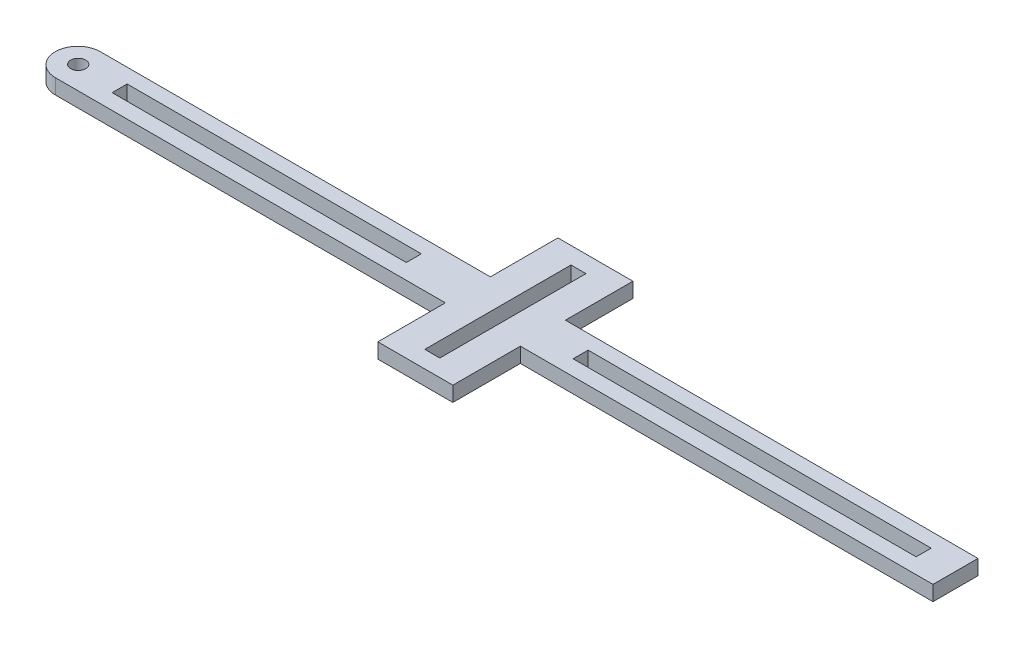
ISO-10303-21;
HEADER;
FILE_DESCRIPTION(('STEP AP214'),'2;1');
FILE_NAME('part.step','',(''),(''),'','','');
FILE_SCHEMA(('AUTOMOTIVE_DESIGN { 1 0 10303 214 1 1 1 1 }'));
ENDSEC;
DATA;
#1=APPLICATION_CONTEXT('core data for automotive mechanical design processes');
#2=APPLICATION_PROTOCOL_DEFINITION('international standard','automotive_design',2000,#1);
#3=PRODUCT_CONTEXT('',#1,'mechanical');
#4=PRODUCT('Part','Part','',(#3));
#5=PRODUCT_RELATED_PRODUCT_CATEGORY('part','',(#4));
#6=PRODUCT_DEFINITION_FORMATION('','',#4);
#7=PRODUCT_DEFINITION_CONTEXT('part definition',#1,'design');
#8=PRODUCT_DEFINITION('design','',#6,#7);
#9=PRODUCT_DEFINITION_SHAPE('','',#8);
#10=(LENGTH_UNIT() NAMED_UNIT(*) SI_UNIT(.MILLI.,.METRE.));
#11=(NAMED_UNIT(*) PLANE_ANGLE_UNIT() SI_UNIT($,.RADIAN.));
#12=(NAMED_UNIT(*) SI_UNIT($,.STERADIAN.) SOLID_ANGLE_UNIT());
#13=UNCERTAINTY_MEASURE_WITH_UNIT(LENGTH_MEASURE(1.E-05),#10,'distance_accuracy_value','');
#14=(GEOMETRIC_REPRESENTATION_CONTEXT(3) GLOBAL_UNCERTAINTY_ASSIGNED_CONTEXT((#13)) GLOBAL_UNIT_ASSIGNED_CONTEXT((#10,
#11,#12)) REPRESENTATION_CONTEXT('',''));
#15=CARTESIAN_POINT('',(0.,0.,0.));
#16=DIRECTION('',(0.,0.,1.));
#17=DIRECTION('',(1.,0.,0.));
#18=AXIS2_PLACEMENT_3D('',#15,#16,#17);
#19=CARTESIAN_POINT('',(0.,2.,0.));
#20=DIRECTION('',(0.,1.,0.));
#21=DIRECTION('',(0.,0.,1.));
#22=AXIS2_PLACEMENT_3D('',#19,#20,#21);
#23=PLANE('',#22);
#24=DIRECTION('',(-1.,0.,0.));
#25=VECTOR('',#24,1.);
#26=CARTESIAN_POINT('',(-60.,2.,-3.));
#27=LINE('',#26,#25);
#28=CARTESIAN_POINT('',(-4.99999999999996,2.,-3.));
#29=VERTEX_POINT('',#28);
#30=CARTESIAN_POINT('',(-57.,2.,-3.));
#31=VERTEX_POINT('',#30);
#32=EDGE_CURVE('E372',#29,#31,#27,.T.);
#33=ORIENTED_EDGE('',*,*,#32,.T.);
#34=CARTESIAN_POINT('',(-57.,2.,0.));
#35=DIRECTION('',(0.,1.,0.));
#36=DIRECTION('',(0.,0.,1.));
#37=AXIS2_PLACEMENT_3D('',#34,#35,#36);
#38=CIRCLE('',#37,3.);
#39=CARTESIAN_POINT('',(-60.,2.,0.));
#40=VERTEX_POINT('',#39);
#41=EDGE_CURVE('E55',#31,#40,#38,.T.);
#42=ORIENTED_EDGE('',*,*,#41,.T.);
#43=CARTESIAN_POINT('',(-57.,2.,0.));
#44=DIRECTION('',(0.,1.,0.));
#45=DIRECTION('',(0.,0.,1.));
#46=AXIS2_PLACEMENT_3D('',#43,#44,#45);
#47=CIRCLE('',#46,3.);
#48=CARTESIAN_POINT('',(-57.,2.,3.));
#49=VERTEX_POINT('',#48);
#50=EDGE_CURVE('E62',#40,#49,#47,.T.);
#51=ORIENTED_EDGE('',*,*,#50,.T.);
#52=DIRECTION('',(1.,0.,0.));
#53=VECTOR('',#52,1.);
#54=CARTESIAN_POINT('',(-60.,2.,3.));
#55=LINE('',#54,#53);
#56=CARTESIAN_POINT('',(-4.99999999999996,2.,3.));
#57=VERTEX_POINT('',#56);
#58=EDGE_CURVE('E375',#49,#57,#55,.T.);
#59=ORIENTED_EDGE('',*,*,#58,.T.);
#60=DIRECTION('',(0.,0.,1.));
#61=VECTOR('',#60,1.);
#62=CARTESIAN_POINT('',(-4.99999999999997,2.,12.));
#63=LINE('',#62,#61);
#64=CARTESIAN_POINT('',(-4.99999999999997,2.,12.));
#65=VERTEX_POINT('',#64);
#66=EDGE_CURVE('E378',#57,#65,#63,.T.);
#67=ORIENTED_EDGE('',*,*,#66,.T.);
#68=DIRECTION('',(1.,0.,0.));
#69=VECTOR('',#68,1.);
#70=CARTESIAN_POINT('',(-4.99999999999997,2.,12.));
#71=LINE('',#70,#69);
#72=CARTESIAN_POINT('',(5.00000000000003,2.,12.));
#73=VERTEX_POINT('',#72);
#74=EDGE_CURVE('E381',#65,#73,#71,.T.);
#75=ORIENTED_EDGE('',*,*,#74,.T.);
#76=DIRECTION('',(0.,0.,-1.));
#77=VECTOR('',#76,1.);
#78=CARTESIAN_POINT('',(5.00000000000003,2.,12.));
#79=LINE('',#78,#77);
#80=CARTESIAN_POINT('',(5.00000000000004,2.,3.));
#81=VERTEX_POINT('',#80);
#82=EDGE_CURVE('E384',#73,#81,#79,.T.);
#83=ORIENTED_EDGE('',*,*,#82,.T.);
#84=DIRECTION('',(1.,0.,0.));
#85=VECTOR('',#84,1.);
#86=CARTESIAN_POINT('',(5.00000000000004,2.,3.));
#87=LINE('',#86,#85);
#88=CARTESIAN_POINT('',(60.,2.,3.));
#89=VERTEX_POINT('',#88);
#90=EDGE_CURVE('E387',#81,#89,#87,.T.);
#91=ORIENTED_EDGE('',*,*,#90,.T.);
#92=DIRECTION('',(0.,0.,-1.));
#93=VECTOR('',#92,1.);
#94=CARTESIAN_POINT('',(60.,2.,3.));
#95=LINE('',#94,#93);
#96=CARTESIAN_POINT('',(60.,2.,-3.));
#97=VERTEX_POINT('',#96);
#98=EDGE_CURVE('E390',#89,#97,#95,.T.);
#99=ORIENTED_EDGE('',*,*,#98,.T.);
#100=DIRECTION('',(-1.,0.,0.));
#101=VECTOR('',#100,1.);
#102=CARTESIAN_POINT('',(5.00000000000004,2.,-3.));
#103=LINE('',#102,#101);
#104=CARTESIAN_POINT('',(5.00000000000004,2.,-3.));
#105=VERTEX_POINT('',#104);
#106=EDGE_CURVE('E358',#97,#105,#103,.T.);
#107=ORIENTED_EDGE('',*,*,#106,.T.);
#108=DIRECTION('',(0.,0.,-1.));
#109=VECTOR('',#108,1.);
#110=CARTESIAN_POINT('',(5.00000000000004,2.,-3.));
#111=LINE('',#110,#109);
#112=CARTESIAN_POINT('',(5.00000000000003,2.,-12.));
#113=VERTEX_POINT('',#112);
#114=EDGE_CURVE('E362',#105,#113,#111,.T.);
#115=ORIENTED_EDGE('',*,*,#114,.T.);
#116=DIRECTION('',(-1.,0.,0.));
#117=VECTOR('',#116,1.);
#118=CARTESIAN_POINT('',(-4.99999999999997,2.,-12.));
#119=LINE('',#118,#117);
#120=CARTESIAN_POINT('',(-4.99999999999997,2.,-12.));
#121=VERTEX_POINT('',#120);
#122=EDGE_CURVE('E366',#113,#121,#119,.T.);
#123=ORIENTED_EDGE('',*,*,#122,.T.);
#124=DIRECTION('',(0.,0.,1.));
#125=VECTOR('',#124,1.);
#126=CARTESIAN_POINT('',(-4.99999999999996,2.,-3.));
#127=LINE('',#126,#125);
#128=EDGE_CURVE('E369',#121,#29,#127,.T.);
#129=ORIENTED_EDGE('',*,*,#128,.T.);
#130=EDGE_LOOP('',(#33,#42,#51,#59,#67,#75,#83,#91,#99,#107,#115,#123,#129));
#131=FACE_BOUND('',#130,.T.);
#132=CARTESIAN_POINT('',(-57.,2.,-0.0574949843376246));
#133=DIRECTION('',(0.,1.,0.));
#134=DIRECTION('',(0.,0.,1.));
#135=AXIS2_PLACEMENT_3D('',#132,#133,#134);
#136=CIRCLE('',#135,0.999999999999998);
#137=CARTESIAN_POINT('',(-57.,2.,0.942505015662373));
#138=VERTEX_POINT('',#137);
#139=EDGE_CURVE('E350',#138,#138,#136,.T.);
#140=ORIENTED_EDGE('',*,*,#139,.F.);
#141=EDGE_LOOP('',(#140));
#142=FACE_BOUND('',#141,.T.);
#143=DIRECTION('',(1.,0.,0.));
#144=VECTOR('',#143,1.);
#145=CARTESIAN_POINT('',(-12.2613313265383,2.,0.942505015662373));
#146=LINE('',#145,#144);
#147=CARTESIAN_POINT('',(-51.4745774109556,2.,0.942505015662377));
#148=VERTEX_POINT('',#147);
#149=CARTESIAN_POINT('',(-12.2613313265383,2.,0.942505015662373));
#150=VERTEX_POINT('',#149);
#151=EDGE_CURVE('E310',#148,#150,#146,.T.);
#152=ORIENTED_EDGE('',*,*,#151,.F.);
#153=DIRECTION('',(0.,0.,1.));
#154=VECTOR('',#153,1.);
#155=CARTESIAN_POINT('',(-51.4745774109556,2.,0.942505015662377));
#156=LINE('',#155,#154);
#157=CARTESIAN_POINT('',(-51.4745774109556,2.,-1.05749498433762));
#158=VERTEX_POINT('',#157);
#159=EDGE_CURVE('E307',#158,#148,#156,.T.);
#160=ORIENTED_EDGE('',*,*,#159,.F.);
#161=DIRECTION('',(-1.,0.,0.));
#162=VECTOR('',#161,1.);
#163=CARTESIAN_POINT('',(-12.2613313265383,2.,-1.05749498433763));
#164=LINE('',#163,#162);
#165=CARTESIAN_POINT('',(-12.2613313265383,2.,-1.05749498433763));
#166=VERTEX_POINT('',#165);
#167=EDGE_CURVE('E318',#166,#158,#164,.T.);
#168=ORIENTED_EDGE('',*,*,#167,.F.);
#169=DIRECTION('',(0.,0.,-1.));
#170=VECTOR('',#169,1.);
#171=CARTESIAN_POINT('',(-12.2613313265383,2.,0.942505015662373));
#172=LINE('',#171,#170);
#173=EDGE_CURVE('E314',#150,#166,#172,.T.);
#174=ORIENTED_EDGE('',*,*,#173,.F.);
#175=EDGE_LOOP('',(#152,#160,#168,#174));
#176=FACE_BOUND('',#175,.T.);
#177=DIRECTION('',(-1.,0.,0.));
#178=VECTOR('',#177,1.);
#179=CARTESIAN_POINT('',(9.96933650610281,2.,-1.05749498433763));
#180=LINE('',#179,#178);
#181=CARTESIAN_POINT('',(55.6961401368462,2.,-1.05749498433763));
#182=VERTEX_POINT('',#181);
#183=CARTESIAN_POINT('',(9.96933650610281,2.,-1.05749498433763));
#184=VERTEX_POINT('',#183);
#185=EDGE_CURVE('E267',#182,#184,#180,.T.);
#186=ORIENTED_EDGE('',*,*,#185,.F.);
#187=DIRECTION('',(0.,0.,-1.));
#188=VECTOR('',#187,1.);
#189=CARTESIAN_POINT('',(55.6961401368462,2.,0.942505015662373));
#190=LINE('',#189,#188);
#191=CARTESIAN_POINT('',(55.6961401368462,2.,0.942505015662373));
#192=VERTEX_POINT('',#191);
#193=EDGE_CURVE('E264',#192,#182,#190,.T.);
#194=ORIENTED_EDGE('',*,*,#193,.F.);
#195=DIRECTION('',(1.,0.,0.));
#196=VECTOR('',#195,1.);
#197=CARTESIAN_POINT('',(9.96933650610281,2.,0.942505015662373));
#198=LINE('',#197,#196);
#199=CARTESIAN_POINT('',(9.96933650610281,2.,0.942505015662373));
#200=VERTEX_POINT('',#199);
#201=EDGE_CURVE('E275',#200,#192,#198,.T.);
#202=ORIENTED_EDGE('',*,*,#201,.F.);
#203=DIRECTION('',(0.,0.,1.));
#204=VECTOR('',#203,1.);
#205=CARTESIAN_POINT('',(9.96933650610281,2.,0.942505015662373));
#206=LINE('',#205,#204);
#207=EDGE_CURVE('E271',#184,#200,#206,.T.);
#208=ORIENTED_EDGE('',*,*,#207,.F.);
#209=EDGE_LOOP('',(#186,#194,#202,#208));
#210=FACE_BOUND('',#209,.T.);
#211=DIRECTION('',(-1.,0.,0.));
#212=VECTOR('',#211,1.);
#213=CARTESIAN_POINT('',(-0.999999999999993,2.,-9.74227650075931));
#214=LINE('',#213,#212);
#215=CARTESIAN_POINT('',(1.00000000000001,2.,-9.74227650075931));
#216=VERTEX_POINT('',#215);
#217=CARTESIAN_POINT('',(-0.999999999999993,2.,-9.74227650075931));
#218=VERTEX_POINT('',#217);
#219=EDGE_CURVE('E222',#216,#218,#214,.T.);
#220=ORIENTED_EDGE('',*,*,#219,.F.);
#221=DIRECTION('',(0.,0.,-1.));
#222=VECTOR('',#221,1.);
#223=CARTESIAN_POINT('',(1.00000000000001,2.,9.74227650075932));
#224=LINE('',#223,#222);
#225=CARTESIAN_POINT('',(1.00000000000001,2.,9.74227650075932));
#226=VERTEX_POINT('',#225);
#227=EDGE_CURVE('E211',#226,#216,#224,.T.);
#228=ORIENTED_EDGE('',*,*,#227,.F.);
#229=DIRECTION('',(1.,0.,0.));
#230=VECTOR('',#229,1.);
#231=CARTESIAN_POINT('',(-0.999999999999993,2.,9.74227650075932));
#232=LINE('',#231,#230);
#233=CARTESIAN_POINT('',(-0.999999999999993,2.,9.74227650075932));
#234=VERTEX_POINT('',#233);
#235=EDGE_CURVE('E240',#234,#226,#232,.T.);
#236=ORIENTED_EDGE('',*,*,#235,.F.);
#237=DIRECTION('',(0.,0.,1.));
#238=VECTOR('',#237,1.);
#239=CARTESIAN_POINT('',(-0.999999999999993,2.,9.74227650075932));
#240=LINE('',#239,#238);
#241=EDGE_CURVE('E236',#218,#234,#240,.T.);
#242=ORIENTED_EDGE('',*,*,#241,.F.);
#243=EDGE_LOOP('',(#220,#228,#236,#242));
#244=FACE_BOUND('',#243,.T.);
#245=ADVANCED_FACE('F45',(#131,#142,#176,#210,#244),#23,.T.);
#246=CARTESIAN_POINT('',(0.,0.,0.));
#247=DIRECTION('',(0.,1.,0.));
#248=DIRECTION('',(0.,0.,1.));
#249=AXIS2_PLACEMENT_3D('',#246,#247,#248);
#250=PLANE('',#249);
#251=DIRECTION('',(0.,0.,-1.));
#252=VECTOR('',#251,1.);
#253=CARTESIAN_POINT('',(55.6961401368462,0.,0.942505015662373));
#254=LINE('',#253,#252);
#255=CARTESIAN_POINT('',(55.6961401368462,0.,0.942505015662373));
#256=VERTEX_POINT('',#255);
#257=CARTESIAN_POINT('',(55.6961401368462,0.,-1.05749498433763));
#258=VERTEX_POINT('',#257);
#259=EDGE_CURVE('E231',#256,#258,#254,.T.);
#260=ORIENTED_EDGE('',*,*,#259,.T.);
#261=DIRECTION('',(-1.,0.,0.));
#262=VECTOR('',#261,1.);
#263=CARTESIAN_POINT('',(9.96933650610281,0.,-1.05749498433763));
#264=LINE('',#263,#262);
#265=CARTESIAN_POINT('',(9.96933650610281,0.,-1.05749498433763));
#266=VERTEX_POINT('',#265);
#267=EDGE_CURVE('E282',#258,#266,#264,.T.);
#268=ORIENTED_EDGE('',*,*,#267,.T.);
#269=DIRECTION('',(0.,0.,1.));
#270=VECTOR('',#269,1.);
#271=CARTESIAN_POINT('',(9.96933650610281,0.,0.942505015662373));
#272=LINE('',#271,#270);
#273=CARTESIAN_POINT('',(9.96933650610281,0.,0.942505015662373));
#274=VERTEX_POINT('',#273);
#275=EDGE_CURVE('E286',#266,#274,#272,.T.);
#276=ORIENTED_EDGE('',*,*,#275,.T.);
#277=DIRECTION('',(1.,0.,0.));
#278=VECTOR('',#277,1.);
#279=CARTESIAN_POINT('',(9.96933650610281,0.,0.942505015662373));
#280=LINE('',#279,#278);
#281=EDGE_CURVE('E268',#274,#256,#280,.T.);
#282=ORIENTED_EDGE('',*,*,#281,.T.);
#283=EDGE_LOOP('',(#260,#268,#276,#282));
#284=FACE_BOUND('',#283,.T.);
#285=CARTESIAN_POINT('',(-57.,0.,-0.0574949843376246));
#286=DIRECTION('',(0.,1.,0.));
#287=DIRECTION('',(0.,0.,1.));
#288=AXIS2_PLACEMENT_3D('',#285,#286,#287);
#289=CIRCLE('',#288,0.999999999999998);
#290=CARTESIAN_POINT('',(-57.,0.,0.942505015662373));
#291=VERTEX_POINT('',#290);
#292=EDGE_CURVE('E349',#291,#291,#289,.T.);
#293=ORIENTED_EDGE('',*,*,#292,.T.);
#294=EDGE_LOOP('',(#293));
#295=FACE_BOUND('',#294,.T.);
#296=CARTESIAN_POINT('',(-57.,0.,0.));
#297=DIRECTION('',(0.,1.,0.));
#298=DIRECTION('',(0.,0.,1.));
#299=AXIS2_PLACEMENT_3D('',#296,#297,#298);
#300=CIRCLE('',#299,3.);
#301=CARTESIAN_POINT('',(-57.,0.,3.));
#302=VERTEX_POINT('',#301);
#303=CARTESIAN_POINT('',(-60.,0.,0.));
#304=VERTEX_POINT('',#303);
#305=EDGE_CURVE('E466',#302,#304,#300,.F.);
#306=ORIENTED_EDGE('',*,*,#305,.T.);
#307=CARTESIAN_POINT('',(-57.,0.,0.));
#308=DIRECTION('',(0.,1.,0.));
#309=DIRECTION('',(0.,0.,1.));
#310=AXIS2_PLACEMENT_3D('',#307,#308,#309);
#311=CIRCLE('',#310,3.);
#312=CARTESIAN_POINT('',(-57.,0.,-3.));
#313=VERTEX_POINT('',#312);
#314=EDGE_CURVE('E469',#304,#313,#311,.F.);
#315=ORIENTED_EDGE('',*,*,#314,.T.);
#316=DIRECTION('',(-1.,0.,0.));
#317=VECTOR('',#316,1.);
#318=CARTESIAN_POINT('',(-60.,0.,-3.));
#319=LINE('',#318,#317);
#320=CARTESIAN_POINT('',(-4.99999999999996,0.,-3.));
#321=VERTEX_POINT('',#320);
#322=EDGE_CURVE('E406',#321,#313,#319,.T.);
#323=ORIENTED_EDGE('',*,*,#322,.F.);
#324=DIRECTION('',(0.,0.,1.));
#325=VECTOR('',#324,1.);
#326=CARTESIAN_POINT('',(-4.99999999999996,0.,-3.));
#327=LINE('',#326,#325);
#328=CARTESIAN_POINT('',(-4.99999999999997,0.,-12.));
#329=VERTEX_POINT('',#328);
#330=EDGE_CURVE('E403',#329,#321,#327,.T.);
#331=ORIENTED_EDGE('',*,*,#330,.F.);
#332=DIRECTION('',(-1.,0.,0.));
#333=VECTOR('',#332,1.);
#334=CARTESIAN_POINT('',(-4.99999999999997,0.,-12.));
#335=LINE('',#334,#333);
#336=CARTESIAN_POINT('',(5.00000000000003,0.,-12.));
#337=VERTEX_POINT('',#336);
#338=EDGE_CURVE('E400',#337,#329,#335,.T.);
#339=ORIENTED_EDGE('',*,*,#338,.F.);
#340=DIRECTION('',(0.,0.,-1.));
#341=VECTOR('',#340,1.);
#342=CARTESIAN_POINT('',(5.00000000000004,0.,-3.));
#343=LINE('',#342,#341);
#344=CARTESIAN_POINT('',(5.00000000000004,0.,-3.));
#345=VERTEX_POINT('',#344);
#346=EDGE_CURVE('E397',#345,#337,#343,.T.);
#347=ORIENTED_EDGE('',*,*,#346,.F.);
#348=DIRECTION('',(-1.,0.,0.));
#349=VECTOR('',#348,1.);
#350=CARTESIAN_POINT('',(5.00000000000004,0.,-3.));
#351=LINE('',#350,#349);
#352=CARTESIAN_POINT('',(60.,0.,-3.));
#353=VERTEX_POINT('',#352);
#354=EDGE_CURVE('E354',#353,#345,#351,.T.);
#355=ORIENTED_EDGE('',*,*,#354,.F.);
#356=DIRECTION('',(0.,0.,-1.));
#357=VECTOR('',#356,1.);
#358=CARTESIAN_POINT('',(60.,0.,3.));
#359=LINE('',#358,#357);
#360=CARTESIAN_POINT('',(60.,0.,3.));
#361=VERTEX_POINT('',#360);
#362=EDGE_CURVE('E363',#361,#353,#359,.T.);
#363=ORIENTED_EDGE('',*,*,#362,.F.);
#364=DIRECTION('',(1.,0.,0.));
#365=VECTOR('',#364,1.);
#366=CARTESIAN_POINT('',(5.00000000000004,0.,3.));
#367=LINE('',#366,#365);
#368=CARTESIAN_POINT('',(5.00000000000004,0.,3.));
#369=VERTEX_POINT('',#368);
#370=EDGE_CURVE('E422',#369,#361,#367,.T.);
#371=ORIENTED_EDGE('',*,*,#370,.F.);
#372=DIRECTION('',(0.,0.,-1.));
#373=VECTOR('',#372,1.);
#374=CARTESIAN_POINT('',(5.00000000000003,0.,12.));
#375=LINE('',#374,#373);
#376=CARTESIAN_POINT('',(5.00000000000003,0.,12.));
#377=VERTEX_POINT('',#376);
#378=EDGE_CURVE('E419',#377,#369,#375,.T.);
#379=ORIENTED_EDGE('',*,*,#378,.F.);
#380=DIRECTION('',(1.,0.,0.));
#381=VECTOR('',#380,1.);
#382=CARTESIAN_POINT('',(-4.99999999999997,0.,12.));
#383=LINE('',#382,#381);
#384=CARTESIAN_POINT('',(-4.99999999999997,0.,12.));
#385=VERTEX_POINT('',#384);
#386=EDGE_CURVE('E416',#385,#377,#383,.T.);
#387=ORIENTED_EDGE('',*,*,#386,.F.);
#388=DIRECTION('',(0.,0.,1.));
#389=VECTOR('',#388,1.);
#390=CARTESIAN_POINT('',(-4.99999999999997,0.,12.));
#391=LINE('',#390,#389);
#392=CARTESIAN_POINT('',(-4.99999999999996,0.,3.));
#393=VERTEX_POINT('',#392);
#394=EDGE_CURVE('E413',#393,#385,#391,.T.);
#395=ORIENTED_EDGE('',*,*,#394,.F.);
#396=DIRECTION('',(1.,0.,0.));
#397=VECTOR('',#396,1.);
#398=CARTESIAN_POINT('',(-60.,0.,3.));
#399=LINE('',#398,#397);
#400=EDGE_CURVE('E410',#302,#393,#399,.T.);
#401=ORIENTED_EDGE('',*,*,#400,.F.);
#402=EDGE_LOOP('',(#306,#315,#323,#331,#339,#347,#355,#363,#371,#379,#387,#395,#401));
#403=FACE_BOUND('',#402,.T.);
#404=DIRECTION('',(0.,0.,1.));
#405=VECTOR('',#404,1.);
#406=CARTESIAN_POINT('',(-51.4745774109556,0.,0.942505015662377));
#407=LINE('',#406,#405);
#408=CARTESIAN_POINT('',(-51.4745774109556,0.,-1.05749498433762));
#409=VERTEX_POINT('',#408);
#410=CARTESIAN_POINT('',(-51.4745774109556,0.,0.942505015662377));
#411=VERTEX_POINT('',#410);
#412=EDGE_CURVE('E306',#409,#411,#407,.T.);
#413=ORIENTED_EDGE('',*,*,#412,.T.);
#414=DIRECTION('',(1.,0.,0.));
#415=VECTOR('',#414,1.);
#416=CARTESIAN_POINT('',(-12.2613313265383,0.,0.942505015662373));
#417=LINE('',#416,#415);
#418=CARTESIAN_POINT('',(-12.2613313265383,0.,0.942505015662373));
#419=VERTEX_POINT('',#418);
#420=EDGE_CURVE('E325',#411,#419,#417,.T.);
#421=ORIENTED_EDGE('',*,*,#420,.T.);
#422=DIRECTION('',(0.,0.,-1.));
#423=VECTOR('',#422,1.);
#424=CARTESIAN_POINT('',(-12.2613313265383,0.,0.942505015662373));
#425=LINE('',#424,#423);
#426=CARTESIAN_POINT('',(-12.2613313265383,0.,-1.05749498433763));
#427=VERTEX_POINT('',#426);
#428=EDGE_CURVE('E329',#419,#427,#425,.T.);
#429=ORIENTED_EDGE('',*,*,#428,.T.);
#430=DIRECTION('',(-1.,0.,0.));
#431=VECTOR('',#430,1.);
#432=CARTESIAN_POINT('',(-12.2613313265383,0.,-1.05749498433763));
#433=LINE('',#432,#431);
#434=EDGE_CURVE('E311',#427,#409,#433,.T.);
#435=ORIENTED_EDGE('',*,*,#434,.T.);
#436=EDGE_LOOP('',(#413,#421,#429,#435));
#437=FACE_BOUND('',#436,.T.);
#438=DIRECTION('',(0.,0.,-1.));
#439=VECTOR('',#438,1.);
#440=CARTESIAN_POINT('',(1.00000000000001,0.,9.74227650075932));
#441=LINE('',#440,#439);
#442=CARTESIAN_POINT('',(1.00000000000001,0.,9.74227650075932));
#443=VERTEX_POINT('',#442);
#444=CARTESIAN_POINT('',(1.00000000000001,0.,-9.74227650075931));
#445=VERTEX_POINT('',#444);
#446=EDGE_CURVE('E245',#443,#445,#441,.T.);
#447=ORIENTED_EDGE('',*,*,#446,.T.);
#448=DIRECTION('',(-1.,0.,0.));
#449=VECTOR('',#448,1.);
#450=CARTESIAN_POINT('',(-0.999999999999993,0.,-9.74227650075931));
#451=LINE('',#450,#449);
#452=CARTESIAN_POINT('',(-0.999999999999993,0.,-9.74227650075931));
#453=VERTEX_POINT('',#452);
#454=EDGE_CURVE('E229',#445,#453,#451,.T.);
#455=ORIENTED_EDGE('',*,*,#454,.T.);
#456=DIRECTION('',(0.,0.,1.));
#457=VECTOR('',#456,1.);
#458=CARTESIAN_POINT('',(-0.999999999999993,0.,9.74227650075932));
#459=LINE('',#458,#457);
#460=CARTESIAN_POINT('',(-0.999999999999993,0.,9.74227650075932));
#461=VERTEX_POINT('',#460);
#462=EDGE_CURVE('E250',#453,#461,#459,.T.);
#463=ORIENTED_EDGE('',*,*,#462,.T.);
#464=DIRECTION('',(1.,0.,0.));
#465=VECTOR('',#464,1.);
#466=CARTESIAN_POINT('',(-0.999999999999993,0.,9.74227650075932));
#467=LINE('',#466,#465);
#468=EDGE_CURVE('E223',#461,#443,#467,.T.);
#469=ORIENTED_EDGE('',*,*,#468,.T.);
#470=EDGE_LOOP('',(#447,#455,#463,#469));
#471=FACE_BOUND('',#470,.T.);
#472=ADVANCED_FACE('F495',(#284,#295,#403,#437,#471),#250,.F.);
#473=CARTESIAN_POINT('',(5.00000000000004,2.,-3.));
#474=DIRECTION('',(0.,0.,1.));
#475=DIRECTION('',(1.,0.,0.));
#476=AXIS2_PLACEMENT_3D('',#473,#474,#475);
#477=PLANE('',#476);
#478=ORIENTED_EDGE('',*,*,#354,.T.);
#479=DIRECTION('',(0.,-1.,0.));
#480=VECTOR('',#479,1.);
#481=CARTESIAN_POINT('',(5.00000000000004,2.,-3.));
#482=LINE('',#481,#480);
#483=EDGE_CURVE('E462',#105,#345,#482,.T.);
#484=ORIENTED_EDGE('',*,*,#483,.F.);
#485=ORIENTED_EDGE('',*,*,#106,.F.);
#486=DIRECTION('',(0.,-1.,0.));
#487=VECTOR('',#486,1.);
#488=CARTESIAN_POINT('',(60.,2.,-3.));
#489=LINE('',#488,#487);
#490=EDGE_CURVE('E393',#97,#353,#489,.T.);
#491=ORIENTED_EDGE('',*,*,#490,.T.);
#492=EDGE_LOOP('',(#478,#484,#485,#491));
#493=FACE_BOUND('',#492,.T.);
#494=ADVANCED_FACE('F538',(#493),#477,.F.);
#495=CARTESIAN_POINT('',(5.00000000000004,2.,-3.));
#496=DIRECTION('',(-1.,0.,0.));
#497=DIRECTION('',(0.,0.,1.));
#498=AXIS2_PLACEMENT_3D('',#495,#496,#497);
#499=PLANE('',#498);
#500=ORIENTED_EDGE('',*,*,#346,.T.);
#501=DIRECTION('',(0.,-1.,0.));
#502=VECTOR('',#501,1.);
#503=CARTESIAN_POINT('',(5.00000000000003,2.,-12.));
#504=LINE('',#503,#502);
#505=EDGE_CURVE('E458',#113,#337,#504,.T.);
#506=ORIENTED_EDGE('',*,*,#505,.F.);
#507=ORIENTED_EDGE('',*,*,#114,.F.);
#508=ORIENTED_EDGE('',*,*,#483,.T.);
#509=EDGE_LOOP('',(#500,#506,#507,#508));
#510=FACE_BOUND('',#509,.T.);
#511=ADVANCED_FACE('F541',(#510),#499,.F.);
#512=CARTESIAN_POINT('',(-4.99999999999997,2.,-12.));
#513=DIRECTION('',(0.,0.,1.));
#514=DIRECTION('',(1.,0.,0.));
#515=AXIS2_PLACEMENT_3D('',#512,#513,#514);
#516=PLANE('',#515);
#517=ORIENTED_EDGE('',*,*,#338,.T.);
#518=DIRECTION('',(0.,-1.,0.));
#519=VECTOR('',#518,1.);
#520=CARTESIAN_POINT('',(-4.99999999999997,2.,-12.));
#521=LINE('',#520,#519);
#522=EDGE_CURVE('E454',#121,#329,#521,.T.);
#523=ORIENTED_EDGE('',*,*,#522,.F.);
#524=ORIENTED_EDGE('',*,*,#122,.F.);
#525=ORIENTED_EDGE('',*,*,#505,.T.);
#526=EDGE_LOOP('',(#517,#523,#524,#525));
#527=FACE_BOUND('',#526,.T.);
#528=ADVANCED_FACE('F543',(#527),#516,.F.);
#529=CARTESIAN_POINT('',(-4.99999999999996,2.,-3.));
#530=DIRECTION('',(1.,0.,0.));
#531=DIRECTION('',(0.,0.,-1.));
#532=AXIS2_PLACEMENT_3D('',#529,#530,#531);
#533=PLANE('',#532);
#534=ORIENTED_EDGE('',*,*,#330,.T.);
#535=DIRECTION('',(0.,-1.,0.));
#536=VECTOR('',#535,1.);
#537=CARTESIAN_POINT('',(-4.99999999999996,2.,-3.));
#538=LINE('',#537,#536);
#539=EDGE_CURVE('E450',#29,#321,#538,.T.);
#540=ORIENTED_EDGE('',*,*,#539,.F.);
#541=ORIENTED_EDGE('',*,*,#128,.F.);
#542=ORIENTED_EDGE('',*,*,#522,.T.);
#543=EDGE_LOOP('',(#534,#540,#541,#542));
#544=FACE_BOUND('',#543,.T.);
#545=ADVANCED_FACE('F492',(#544),#533,.F.);
#546=CARTESIAN_POINT('',(-60.,2.,-3.));
#547=DIRECTION('',(0.,0.,1.));
#548=DIRECTION('',(1.,0.,0.));
#549=AXIS2_PLACEMENT_3D('',#546,#547,#548);
#550=PLANE('',#549);
#551=ORIENTED_EDGE('',*,*,#322,.T.);
#552=DIRECTION('',(0.,-1.,0.));
#553=VECTOR('',#552,1.);
#554=CARTESIAN_POINT('',(-57.,2.,-3.));
#555=LINE('',#554,#553);
#556=EDGE_CURVE('E472',#313,#31,#555,.F.);
#557=ORIENTED_EDGE('',*,*,#556,.T.);
#558=ORIENTED_EDGE('',*,*,#32,.F.);
#559=ORIENTED_EDGE('',*,*,#539,.T.);
#560=EDGE_LOOP('',(#551,#557,#558,#559));
#561=FACE_BOUND('',#560,.T.);
#562=ADVANCED_FACE('F482',(#561),#550,.F.);
#563=CARTESIAN_POINT('',(-60.,2.,3.));
#564=DIRECTION('',(0.,0.,-1.));
#565=DIRECTION('',(-1.,0.,0.));
#566=AXIS2_PLACEMENT_3D('',#563,#564,#565);
#567=PLANE('',#566);
#568=ORIENTED_EDGE('',*,*,#58,.F.);
#569=DIRECTION('',(0.,-1.,0.));
#570=VECTOR('',#569,1.);
#571=CARTESIAN_POINT('',(-57.,2.,3.));
#572=LINE('',#571,#570);
#573=EDGE_CURVE('E11',#49,#302,#572,.T.);
#574=ORIENTED_EDGE('',*,*,#573,.T.);
#575=ORIENTED_EDGE('',*,*,#400,.T.);
#576=DIRECTION('',(0.,-1.,0.));
#577=VECTOR('',#576,1.);
#578=CARTESIAN_POINT('',(-4.99999999999996,2.,3.));
#579=LINE('',#578,#577);
#580=EDGE_CURVE('E446',#57,#393,#579,.T.);
#581=ORIENTED_EDGE('',*,*,#580,.F.);
#582=EDGE_LOOP('',(#568,#574,#575,#581));
#583=FACE_BOUND('',#582,.T.);
#584=ADVANCED_FACE('F507',(#583),#567,.F.);
#585=CARTESIAN_POINT('',(-4.99999999999997,2.,12.));
#586=DIRECTION('',(1.,0.,0.));
#587=DIRECTION('',(0.,0.,-1.));
#588=AXIS2_PLACEMENT_3D('',#585,#586,#587);
#589=PLANE('',#588);
#590=ORIENTED_EDGE('',*,*,#394,.T.);
#591=DIRECTION('',(0.,-1.,0.));
#592=VECTOR('',#591,1.);
#593=CARTESIAN_POINT('',(-4.99999999999997,2.,12.));
#594=LINE('',#593,#592);
#595=EDGE_CURVE('E442',#65,#385,#594,.T.);
#596=ORIENTED_EDGE('',*,*,#595,.F.);
#597=ORIENTED_EDGE('',*,*,#66,.F.);
#598=ORIENTED_EDGE('',*,*,#580,.T.);
#599=EDGE_LOOP('',(#590,#596,#597,#598));
#600=FACE_BOUND('',#599,.T.);
#601=ADVANCED_FACE('F514',(#600),#589,.F.);
#602=CARTESIAN_POINT('',(-4.99999999999997,2.,12.));
#603=DIRECTION('',(0.,0.,-1.));
#604=DIRECTION('',(-1.,0.,0.));
#605=AXIS2_PLACEMENT_3D('',#602,#603,#604);
#606=PLANE('',#605);
#607=ORIENTED_EDGE('',*,*,#386,.T.);
#608=DIRECTION('',(0.,-1.,0.));
#609=VECTOR('',#608,1.);
#610=CARTESIAN_POINT('',(5.00000000000003,2.,12.));
#611=LINE('',#610,#609);
#612=EDGE_CURVE('E438',#73,#377,#611,.T.);
#613=ORIENTED_EDGE('',*,*,#612,.F.);
#614=ORIENTED_EDGE('',*,*,#74,.F.);
#615=ORIENTED_EDGE('',*,*,#595,.T.);
#616=EDGE_LOOP('',(#607,#613,#614,#615));
#617=FACE_BOUND('',#616,.T.);
#618=ADVANCED_FACE('F518',(#617),#606,.F.);
#619=CARTESIAN_POINT('',(5.00000000000003,2.,12.));
#620=DIRECTION('',(-1.,0.,0.));
#621=DIRECTION('',(0.,0.,1.));
#622=AXIS2_PLACEMENT_3D('',#619,#620,#621);
#623=PLANE('',#622);
#624=ORIENTED_EDGE('',*,*,#378,.T.);
#625=DIRECTION('',(0.,-1.,0.));
#626=VECTOR('',#625,1.);
#627=CARTESIAN_POINT('',(5.00000000000004,2.,3.));
#628=LINE('',#627,#626);
#629=EDGE_CURVE('E434',#81,#369,#628,.T.);
#630=ORIENTED_EDGE('',*,*,#629,.F.);
#631=ORIENTED_EDGE('',*,*,#82,.F.);
#632=ORIENTED_EDGE('',*,*,#612,.T.);
#633=EDGE_LOOP('',(#624,#630,#631,#632));
#634=FACE_BOUND('',#633,.T.);
#635=ADVANCED_FACE('F525',(#634),#623,.F.);
#636=CARTESIAN_POINT('',(5.00000000000004,2.,3.));
#637=DIRECTION('',(0.,0.,-1.));
#638=DIRECTION('',(-1.,0.,0.));
#639=AXIS2_PLACEMENT_3D('',#636,#637,#638);
#640=PLANE('',#639);
#641=ORIENTED_EDGE('',*,*,#370,.T.);
#642=DIRECTION('',(0.,-1.,0.));
#643=VECTOR('',#642,1.);
#644=CARTESIAN_POINT('',(60.,2.,3.));
#645=LINE('',#644,#643);
#646=EDGE_CURVE('E430',#89,#361,#645,.T.);
#647=ORIENTED_EDGE('',*,*,#646,.F.);
#648=ORIENTED_EDGE('',*,*,#90,.F.);
#649=ORIENTED_EDGE('',*,*,#629,.T.);
#650=EDGE_LOOP('',(#641,#647,#648,#649));
#651=FACE_BOUND('',#650,.T.);
#652=ADVANCED_FACE('F528',(#651),#640,.F.);
#653=CARTESIAN_POINT('',(60.,2.,3.));
#654=DIRECTION('',(-1.,0.,0.));
#655=DIRECTION('',(0.,0.,1.));
#656=AXIS2_PLACEMENT_3D('',#653,#654,#655);
#657=PLANE('',#656);
#658=ORIENTED_EDGE('',*,*,#362,.T.);
#659=ORIENTED_EDGE('',*,*,#490,.F.);
#660=ORIENTED_EDGE('',*,*,#98,.F.);
#661=ORIENTED_EDGE('',*,*,#646,.T.);
#662=EDGE_LOOP('',(#658,#659,#660,#661));
#663=FACE_BOUND('',#662,.T.);
#664=ADVANCED_FACE('F533',(#663),#657,.F.);
#665=CARTESIAN_POINT('',(-57.,2.,-0.0574949843376246));
#666=DIRECTION('',(0.,-1.,0.));
#667=DIRECTION('',(0.,0.,-1.));
#668=AXIS2_PLACEMENT_3D('',#665,#666,#667);
#669=CYLINDRICAL_SURFACE('',#668,0.999999999999998);
#670=ORIENTED_EDGE('',*,*,#139,.T.);
#671=EDGE_LOOP('',(#670));
#672=FACE_BOUND('',#671,.T.);
#673=ORIENTED_EDGE('',*,*,#292,.F.);
#674=EDGE_LOOP('',(#673));
#675=FACE_BOUND('',#674,.T.);
#676=ADVANCED_FACE('F561',(#672,#675),#669,.F.);
#677=CARTESIAN_POINT('',(-51.4745774109556,2.,0.942505015662377));
#678=DIRECTION('',(1.,0.,0.));
#679=DIRECTION('',(0.,0.,-1.));
#680=AXIS2_PLACEMENT_3D('',#677,#678,#679);
#681=PLANE('',#680);
#682=ORIENTED_EDGE('',*,*,#412,.F.);
#683=DIRECTION('',(0.,-1.,0.));
#684=VECTOR('',#683,1.);
#685=CARTESIAN_POINT('',(-51.4745774109556,2.,-1.05749498433762));
#686=LINE('',#685,#684);
#687=EDGE_CURVE('E321',#158,#409,#686,.T.);
#688=ORIENTED_EDGE('',*,*,#687,.F.);
#689=ORIENTED_EDGE('',*,*,#159,.T.);
#690=DIRECTION('',(0.,-1.,0.));
#691=VECTOR('',#690,1.);
#692=CARTESIAN_POINT('',(-51.4745774109556,2.,0.942505015662377));
#693=LINE('',#692,#691);
#694=EDGE_CURVE('E345',#148,#411,#693,.T.);
#695=ORIENTED_EDGE('',*,*,#694,.T.);
#696=EDGE_LOOP('',(#682,#688,#689,#695));
#697=FACE_BOUND('',#696,.T.);
#698=ADVANCED_FACE('F696',(#697),#681,.T.);
#699=CARTESIAN_POINT('',(-12.2613313265383,2.,0.942505015662373));
#700=DIRECTION('',(0.,0.,-1.));
#701=DIRECTION('',(-1.,0.,0.));
#702=AXIS2_PLACEMENT_3D('',#699,#700,#701);
#703=PLANE('',#702);
#704=ORIENTED_EDGE('',*,*,#420,.F.);
#705=ORIENTED_EDGE('',*,*,#694,.F.);
#706=ORIENTED_EDGE('',*,*,#151,.T.);
#707=DIRECTION('',(0.,-1.,0.));
#708=VECTOR('',#707,1.);
#709=CARTESIAN_POINT('',(-12.2613313265383,2.,0.942505015662373));
#710=LINE('',#709,#708);
#711=EDGE_CURVE('E342',#150,#419,#710,.T.);
#712=ORIENTED_EDGE('',*,*,#711,.T.);
#713=EDGE_LOOP('',(#704,#705,#706,#712));
#714=FACE_BOUND('',#713,.T.);
#715=ADVANCED_FACE('F687',(#714),#703,.T.);
#716=CARTESIAN_POINT('',(-12.2613313265383,2.,0.942505015662373));
#717=DIRECTION('',(-1.,0.,0.));
#718=DIRECTION('',(0.,0.,1.));
#719=AXIS2_PLACEMENT_3D('',#716,#717,#718);
#720=PLANE('',#719);
#721=ORIENTED_EDGE('',*,*,#428,.F.);
#722=ORIENTED_EDGE('',*,*,#711,.F.);
#723=ORIENTED_EDGE('',*,*,#173,.T.);
#724=DIRECTION('',(0.,-1.,0.));
#725=VECTOR('',#724,1.);
#726=CARTESIAN_POINT('',(-12.2613313265383,2.,-1.05749498433763));
#727=LINE('',#726,#725);
#728=EDGE_CURVE('E339',#166,#427,#727,.T.);
#729=ORIENTED_EDGE('',*,*,#728,.T.);
#730=EDGE_LOOP('',(#721,#722,#723,#729));
#731=FACE_BOUND('',#730,.T.);
#732=ADVANCED_FACE('F678',(#731),#720,.T.);
#733=CARTESIAN_POINT('',(-12.2613313265383,2.,-1.05749498433763));
#734=DIRECTION('',(0.,0.,1.));
#735=DIRECTION('',(1.,0.,0.));
#736=AXIS2_PLACEMENT_3D('',#733,#734,#735);
#737=PLANE('',#736);
#738=ORIENTED_EDGE('',*,*,#434,.F.);
#739=ORIENTED_EDGE('',*,*,#728,.F.);
#740=ORIENTED_EDGE('',*,*,#167,.T.);
#741=ORIENTED_EDGE('',*,*,#687,.T.);
#742=EDGE_LOOP('',(#738,#739,#740,#741));
#743=FACE_BOUND('',#742,.T.);
#744=ADVANCED_FACE('F669',(#743),#737,.T.);
#745=CARTESIAN_POINT('',(55.6961401368462,2.,0.942505015662373));
#746=DIRECTION('',(-1.,0.,0.));
#747=DIRECTION('',(0.,0.,1.));
#748=AXIS2_PLACEMENT_3D('',#745,#746,#747);
#749=PLANE('',#748);
#750=ORIENTED_EDGE('',*,*,#259,.F.);
#751=DIRECTION('',(0.,-1.,0.));
#752=VECTOR('',#751,1.);
#753=CARTESIAN_POINT('',(55.6961401368462,2.,0.942505015662373));
#754=LINE('',#753,#752);
#755=EDGE_CURVE('E278',#192,#256,#754,.T.);
#756=ORIENTED_EDGE('',*,*,#755,.F.);
#757=ORIENTED_EDGE('',*,*,#193,.T.);
#758=DIRECTION('',(0.,-1.,0.));
#759=VECTOR('',#758,1.);
#760=CARTESIAN_POINT('',(55.6961401368462,2.,-1.05749498433763));
#761=LINE('',#760,#759);
#762=EDGE_CURVE('E302',#182,#258,#761,.T.);
#763=ORIENTED_EDGE('',*,*,#762,.T.);
#764=EDGE_LOOP('',(#750,#756,#757,#763));
#765=FACE_BOUND('',#764,.T.);
#766=ADVANCED_FACE('F660',(#765),#749,.T.);
#767=CARTESIAN_POINT('',(9.96933650610281,2.,-1.05749498433763));
#768=DIRECTION('',(0.,0.,1.));
#769=DIRECTION('',(1.,0.,0.));
#770=AXIS2_PLACEMENT_3D('',#767,#768,#769);
#771=PLANE('',#770);
#772=ORIENTED_EDGE('',*,*,#267,.F.);
#773=ORIENTED_EDGE('',*,*,#762,.F.);
#774=ORIENTED_EDGE('',*,*,#185,.T.);
#775=DIRECTION('',(0.,-1.,0.));
#776=VECTOR('',#775,1.);
#777=CARTESIAN_POINT('',(9.96933650610281,2.,-1.05749498433763));
#778=LINE('',#777,#776);
#779=EDGE_CURVE('E299',#184,#266,#778,.T.);
#780=ORIENTED_EDGE('',*,*,#779,.T.);
#781=EDGE_LOOP('',(#772,#773,#774,#780));
#782=FACE_BOUND('',#781,.T.);
#783=ADVANCED_FACE('F651',(#782),#771,.T.);
#784=CARTESIAN_POINT('',(9.96933650610281,2.,0.942505015662373));
#785=DIRECTION('',(1.,0.,0.));
#786=DIRECTION('',(0.,0.,-1.));
#787=AXIS2_PLACEMENT_3D('',#784,#785,#786);
#788=PLANE('',#787);
#789=ORIENTED_EDGE('',*,*,#275,.F.);
#790=ORIENTED_EDGE('',*,*,#779,.F.);
#791=ORIENTED_EDGE('',*,*,#207,.T.);
#792=DIRECTION('',(0.,-1.,0.));
#793=VECTOR('',#792,1.);
#794=CARTESIAN_POINT('',(9.96933650610281,2.,0.942505015662373));
#795=LINE('',#794,#793);
#796=EDGE_CURVE('E296',#200,#274,#795,.T.);
#797=ORIENTED_EDGE('',*,*,#796,.T.);
#798=EDGE_LOOP('',(#789,#790,#791,#797));
#799=FACE_BOUND('',#798,.T.);
#800=ADVANCED_FACE('F642',(#799),#788,.T.);
#801=CARTESIAN_POINT('',(9.96933650610281,2.,0.942505015662373));
#802=DIRECTION('',(0.,0.,-1.));
#803=DIRECTION('',(-1.,0.,0.));
#804=AXIS2_PLACEMENT_3D('',#801,#802,#803);
#805=PLANE('',#804);
#806=ORIENTED_EDGE('',*,*,#281,.F.);
#807=ORIENTED_EDGE('',*,*,#796,.F.);
#808=ORIENTED_EDGE('',*,*,#201,.T.);
#809=ORIENTED_EDGE('',*,*,#755,.T.);
#810=EDGE_LOOP('',(#806,#807,#808,#809));
#811=FACE_BOUND('',#810,.T.);
#812=ADVANCED_FACE('F634',(#811),#805,.T.);
#813=CARTESIAN_POINT('',(1.00000000000001,2.,9.74227650075932));
#814=DIRECTION('',(-1.,0.,0.));
#815=DIRECTION('',(0.,0.,1.));
#816=AXIS2_PLACEMENT_3D('',#813,#814,#815);
#817=PLANE('',#816);
#818=ORIENTED_EDGE('',*,*,#446,.F.);
#819=DIRECTION('',(0.,-1.,0.));
#820=VECTOR('',#819,1.);
#821=CARTESIAN_POINT('',(1.00000000000001,2.,9.74227650075932));
#822=LINE('',#821,#820);
#823=EDGE_CURVE('E217',#226,#443,#822,.T.);
#824=ORIENTED_EDGE('',*,*,#823,.F.);
#825=ORIENTED_EDGE('',*,*,#227,.T.);
#826=DIRECTION('',(0.,-1.,0.));
#827=VECTOR('',#826,1.);
#828=CARTESIAN_POINT('',(1.00000000000001,2.,-9.74227650075931));
#829=LINE('',#828,#827);
#830=EDGE_CURVE('E214',#216,#445,#829,.T.);
#831=ORIENTED_EDGE('',*,*,#830,.T.);
#832=EDGE_LOOP('',(#818,#824,#825,#831));
#833=FACE_BOUND('',#832,.T.);
#834=ADVANCED_FACE('F213',(#833),#817,.T.);
#835=CARTESIAN_POINT('',(-0.999999999999993,2.,-9.74227650075931));
#836=DIRECTION('',(0.,0.,1.));
#837=DIRECTION('',(1.,0.,0.));
#838=AXIS2_PLACEMENT_3D('',#835,#836,#837);
#839=PLANE('',#838);
#840=ORIENTED_EDGE('',*,*,#454,.F.);
#841=ORIENTED_EDGE('',*,*,#830,.F.);
#842=ORIENTED_EDGE('',*,*,#219,.T.);
#843=DIRECTION('',(0.,-1.,0.));
#844=VECTOR('',#843,1.);
#845=CARTESIAN_POINT('',(-0.999999999999993,2.,-9.74227650075931));
#846=LINE('',#845,#844);
#847=EDGE_CURVE('E232',#218,#453,#846,.T.);
#848=ORIENTED_EDGE('',*,*,#847,.T.);
#849=EDGE_LOOP('',(#840,#841,#842,#848));
#850=FACE_BOUND('',#849,.T.);
#851=ADVANCED_FACE('F226',(#850),#839,.T.);
#852=CARTESIAN_POINT('',(-0.999999999999993,2.,9.74227650075932));
#853=DIRECTION('',(1.,0.,0.));
#854=DIRECTION('',(0.,0.,-1.));
#855=AXIS2_PLACEMENT_3D('',#852,#853,#854);
#856=PLANE('',#855);
#857=ORIENTED_EDGE('',*,*,#462,.F.);
#858=ORIENTED_EDGE('',*,*,#847,.F.);
#859=ORIENTED_EDGE('',*,*,#241,.T.);
#860=DIRECTION('',(0.,-1.,0.));
#861=VECTOR('',#860,1.);
#862=CARTESIAN_POINT('',(-0.999999999999993,2.,9.74227650075932));
#863=LINE('',#862,#861);
#864=EDGE_CURVE('E259',#234,#461,#863,.T.);
#865=ORIENTED_EDGE('',*,*,#864,.T.);
#866=EDGE_LOOP('',(#857,#858,#859,#865));
#867=FACE_BOUND('',#866,.T.);
#868=ADVANCED_FACE('F610',(#867),#856,.T.);
#869=CARTESIAN_POINT('',(-0.999999999999993,2.,9.74227650075932));
#870=DIRECTION('',(0.,0.,-1.));
#871=DIRECTION('',(-1.,0.,0.));
#872=AXIS2_PLACEMENT_3D('',#869,#870,#871);
#873=PLANE('',#872);
#874=ORIENTED_EDGE('',*,*,#468,.F.);
#875=ORIENTED_EDGE('',*,*,#864,.F.);
#876=ORIENTED_EDGE('',*,*,#235,.T.);
#877=ORIENTED_EDGE('',*,*,#823,.T.);
#878=EDGE_LOOP('',(#874,#875,#876,#877));
#879=FACE_BOUND('',#878,.T.);
#880=ADVANCED_FACE('F595',(#879),#873,.T.);
#881=CARTESIAN_POINT('',(-57.,2.,0.));
#882=DIRECTION('',(0.,-1.,0.));
#883=DIRECTION('',(0.,0.,-1.));
#884=AXIS2_PLACEMENT_3D('',#881,#882,#883);
#885=CYLINDRICAL_SURFACE('',#884,3.);
#886=ORIENTED_EDGE('',*,*,#573,.F.);
#887=ORIENTED_EDGE('',*,*,#50,.F.);
#888=DIRECTION('',(0.,-1.,0.));
#889=VECTOR('',#888,1.);
#890=CARTESIAN_POINT('',(-60.,2.,0.));
#891=LINE('',#890,#889);
#892=EDGE_CURVE('E49',#304,#40,#891,.F.);
#893=ORIENTED_EDGE('',*,*,#892,.F.);
#894=ORIENTED_EDGE('',*,*,#305,.F.);
#895=EDGE_LOOP('',(#886,#887,#893,#894));
#896=FACE_BOUND('',#895,.T.);
#897=ADVANCED_FACE('F47',(#896),#885,.T.);
#898=CARTESIAN_POINT('',(-57.,2.,0.));
#899=DIRECTION('',(0.,-1.,0.));
#900=DIRECTION('',(0.,0.,-1.));
#901=AXIS2_PLACEMENT_3D('',#898,#899,#900);
#902=CYLINDRICAL_SURFACE('',#901,3.);
#903=ORIENTED_EDGE('',*,*,#41,.F.);
#904=ORIENTED_EDGE('',*,*,#556,.F.);
#905=ORIENTED_EDGE('',*,*,#314,.F.);
#906=ORIENTED_EDGE('',*,*,#892,.T.);
#907=EDGE_LOOP('',(#903,#904,#905,#906));
#908=FACE_BOUND('',#907,.T.);
#909=ADVANCED_FACE('F502',(#908),#902,.T.);
#910=CLOSED_SHELL('',(#245,#472,#494,#511,#528,#545,#562,#584,#601,#618,#635,#652,#664,#676,
#698,#715,#732,#744,#766,#783,#800,#812,#834,#851,#868,#880,#897,#909));
#911=MANIFOLD_SOLID_BREP('B2',#910);
#912=ADVANCED_BREP_SHAPE_REPRESENTATION('',(#18,#911),#14);
#913=SHAPE_DEFINITION_REPRESENTATION(#9,#912);
ENDSEC;
END-ISO-10303-21;
